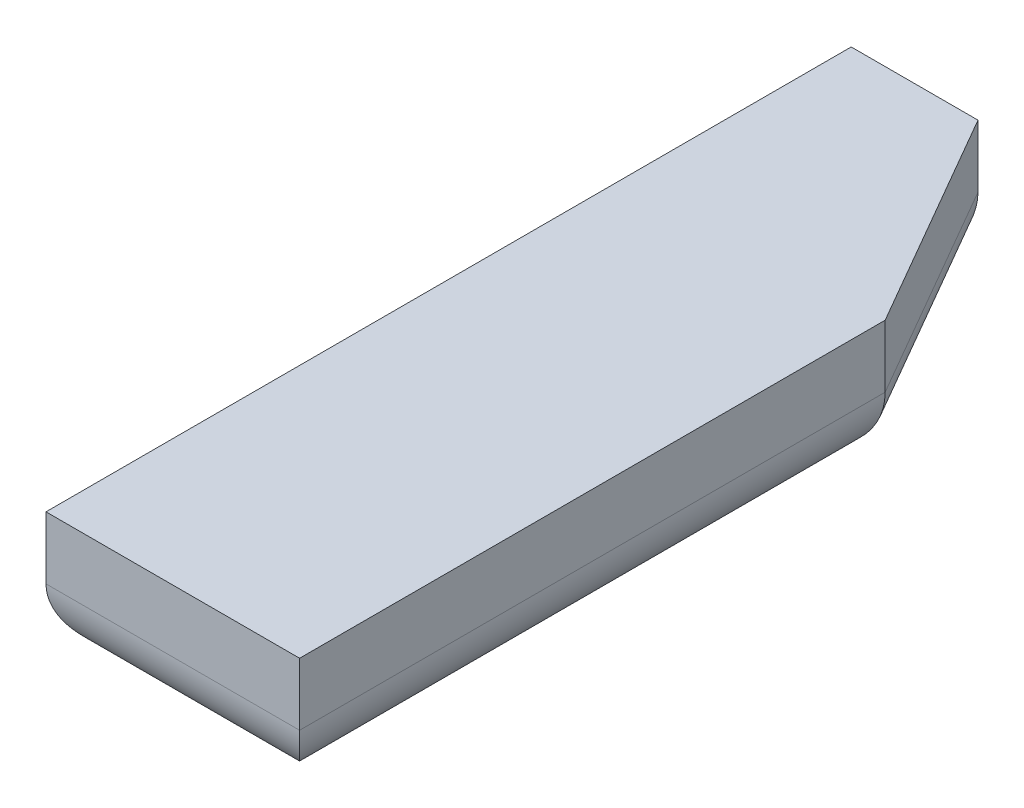
ISO-10303-21;
HEADER;
FILE_DESCRIPTION(('STEP AP214'),'2;1');
FILE_NAME('part.step','',(''),(''),'','','');
FILE_SCHEMA(('AUTOMOTIVE_DESIGN { 1 0 10303 214 1 1 1 1 }'));
ENDSEC;
DATA;
#1=APPLICATION_CONTEXT('core data for automotive mechanical design processes');
#2=APPLICATION_PROTOCOL_DEFINITION('international standard','automotive_design',2000,#1);
#3=PRODUCT_CONTEXT('',#1,'mechanical');
#4=PRODUCT('Part','Part','',(#3));
#5=PRODUCT_RELATED_PRODUCT_CATEGORY('part','',(#4));
#6=PRODUCT_DEFINITION_FORMATION('','',#4);
#7=PRODUCT_DEFINITION_CONTEXT('part definition',#1,'design');
#8=PRODUCT_DEFINITION('design','',#6,#7);
#9=PRODUCT_DEFINITION_SHAPE('','',#8);
#10=(LENGTH_UNIT() NAMED_UNIT(*) SI_UNIT(.MILLI.,.METRE.));
#11=(NAMED_UNIT(*) PLANE_ANGLE_UNIT() SI_UNIT($,.RADIAN.));
#12=(NAMED_UNIT(*) SI_UNIT($,.STERADIAN.) SOLID_ANGLE_UNIT());
#13=UNCERTAINTY_MEASURE_WITH_UNIT(LENGTH_MEASURE(1.E-05),#10,'distance_accuracy_value','');
#14=(GEOMETRIC_REPRESENTATION_CONTEXT(3) GLOBAL_UNCERTAINTY_ASSIGNED_CONTEXT((#13)) GLOBAL_UNIT_ASSIGNED_CONTEXT((#10,
#11,#12)) REPRESENTATION_CONTEXT('',''));
#15=CARTESIAN_POINT('',(0.,0.,0.));
#16=DIRECTION('',(0.,0.,1.));
#17=DIRECTION('',(1.,0.,0.));
#18=AXIS2_PLACEMENT_3D('',#15,#16,#17);
#19=CARTESIAN_POINT('',(-10.,10.,31.75));
#20=DIRECTION('',(0.,0.,-1.));
#21=DIRECTION('',(-1.,0.,0.));
#22=AXIS2_PLACEMENT_3D('',#19,#20,#21);
#23=PLANE('',#22);
#24=DIRECTION('',(0.,-1.,0.));
#25=VECTOR('',#24,1.);
#26=CARTESIAN_POINT('',(-10.,10.,31.75));
#27=LINE('',#26,#25);
#28=CARTESIAN_POINT('',(-10.,10.,31.75));
#29=VERTEX_POINT('',#28);
#30=CARTESIAN_POINT('',(-10.,5.08,31.75));
#31=VERTEX_POINT('',#30);
#32=EDGE_CURVE('E176',#29,#31,#27,.T.);
#33=ORIENTED_EDGE('',*,*,#32,.T.);
#34=DIRECTION('',(1.,0.,0.));
#35=VECTOR('',#34,1.);
#36=CARTESIAN_POINT('',(-10.,5.08,31.75));
#37=LINE('',#36,#35);
#38=CARTESIAN_POINT('',(10.,5.08,31.75));
#39=VERTEX_POINT('',#38);
#40=EDGE_CURVE('E11',#31,#39,#37,.T.);
#41=ORIENTED_EDGE('',*,*,#40,.T.);
#42=DIRECTION('',(0.,-1.,0.));
#43=VECTOR('',#42,1.);
#44=CARTESIAN_POINT('',(10.,10.,31.75));
#45=LINE('',#44,#43);
#46=CARTESIAN_POINT('',(10.,10.,31.75));
#47=VERTEX_POINT('',#46);
#48=EDGE_CURVE('E103',#47,#39,#45,.T.);
#49=ORIENTED_EDGE('',*,*,#48,.F.);
#50=DIRECTION('',(1.,0.,0.));
#51=VECTOR('',#50,1.);
#52=CARTESIAN_POINT('',(-10.,10.,31.75));
#53=LINE('',#52,#51);
#54=EDGE_CURVE('E110',#29,#47,#53,.T.);
#55=ORIENTED_EDGE('',*,*,#54,.F.);
#56=EDGE_LOOP('',(#33,#41,#49,#55));
#57=FACE_BOUND('',#56,.T.);
#58=ADVANCED_FACE('F33',(#57),#23,.F.);
#59=CARTESIAN_POINT('',(10.,10.,31.75));
#60=DIRECTION('',(-1.,0.,0.));
#61=DIRECTION('',(0.,0.,1.));
#62=AXIS2_PLACEMENT_3D('',#59,#60,#61);
#63=PLANE('',#62);
#64=ORIENTED_EDGE('',*,*,#48,.T.);
#65=DIRECTION('',(0.,0.,-1.));
#66=VECTOR('',#65,1.);
#67=CARTESIAN_POINT('',(10.,5.08,31.75));
#68=LINE('',#67,#66);
#69=CARTESIAN_POINT('',(10.,5.08,-14.4294919243111));
#70=VERTEX_POINT('',#69);
#71=EDGE_CURVE('E119',#39,#70,#68,.T.);
#72=ORIENTED_EDGE('',*,*,#71,.T.);
#73=DIRECTION('',(0.,-1.,0.));
#74=VECTOR('',#73,1.);
#75=CARTESIAN_POINT('',(10.,10.,-14.4294919243111));
#76=LINE('',#75,#74);
#77=CARTESIAN_POINT('',(10.,10.,-14.4294919243111));
#78=VERTEX_POINT('',#77);
#79=EDGE_CURVE('E106',#78,#70,#76,.T.);
#80=ORIENTED_EDGE('',*,*,#79,.F.);
#81=DIRECTION('',(0.,0.,-1.));
#82=VECTOR('',#81,1.);
#83=CARTESIAN_POINT('',(10.,10.,31.75));
#84=LINE('',#83,#82);
#85=EDGE_CURVE('E98',#47,#78,#84,.T.);
#86=ORIENTED_EDGE('',*,*,#85,.F.);
#87=EDGE_LOOP('',(#64,#72,#80,#86));
#88=FACE_BOUND('',#87,.T.);
#89=ADVANCED_FACE('F100',(#88),#63,.F.);
#90=CARTESIAN_POINT('',(10.,10.,-14.4294919243111));
#91=DIRECTION('',(-0.86602540378444,0.,0.499999999999998));
#92=DIRECTION('',(0.499999999999998,0.,0.86602540378444));
#93=AXIS2_PLACEMENT_3D('',#90,#91,#92);
#94=PLANE('',#93);
#95=ORIENTED_EDGE('',*,*,#79,.T.);
#96=DIRECTION('',(-0.499999999999998,0.,-0.86602540378444));
#97=VECTOR('',#96,1.);
#98=CARTESIAN_POINT('',(10.,5.08,-14.4294919243111));
#99=LINE('',#98,#97);
#100=CARTESIAN_POINT('',(0.,5.08,-31.75));
#101=VERTEX_POINT('',#100);
#102=EDGE_CURVE('E137',#70,#101,#99,.T.);
#103=ORIENTED_EDGE('',*,*,#102,.T.);
#104=DIRECTION('',(0.,-1.,0.));
#105=VECTOR('',#104,1.);
#106=CARTESIAN_POINT('',(0.,10.,-31.75));
#107=LINE('',#106,#105);
#108=CARTESIAN_POINT('',(0.,10.,-31.75));
#109=VERTEX_POINT('',#108);
#110=EDGE_CURVE('E123',#109,#101,#107,.T.);
#111=ORIENTED_EDGE('',*,*,#110,.F.);
#112=DIRECTION('',(-0.499999999999998,0.,-0.86602540378444));
#113=VECTOR('',#112,1.);
#114=CARTESIAN_POINT('',(10.,10.,-14.4294919243111));
#115=LINE('',#114,#113);
#116=EDGE_CURVE('E109',#78,#109,#115,.T.);
#117=ORIENTED_EDGE('',*,*,#116,.F.);
#118=EDGE_LOOP('',(#95,#103,#111,#117));
#119=FACE_BOUND('',#118,.T.);
#120=ADVANCED_FACE('F168',(#119),#94,.F.);
#121=CARTESIAN_POINT('',(0.,10.,-31.75));
#122=DIRECTION('',(0.,0.,1.));
#123=DIRECTION('',(1.,0.,0.));
#124=AXIS2_PLACEMENT_3D('',#121,#122,#123);
#125=PLANE('',#124);
#126=ORIENTED_EDGE('',*,*,#110,.T.);
#127=DIRECTION('',(-1.,0.,0.));
#128=VECTOR('',#127,1.);
#129=CARTESIAN_POINT('',(0.,5.08,-31.75));
#130=LINE('',#129,#128);
#131=CARTESIAN_POINT('',(-10.,5.08,-31.75));
#132=VERTEX_POINT('',#131);
#133=EDGE_CURVE('E57',#101,#132,#130,.T.);
#134=ORIENTED_EDGE('',*,*,#133,.T.);
#135=DIRECTION('',(0.,-1.,0.));
#136=VECTOR('',#135,1.);
#137=CARTESIAN_POINT('',(-10.,10.,-31.75));
#138=LINE('',#137,#136);
#139=CARTESIAN_POINT('',(-10.,10.,-31.75));
#140=VERTEX_POINT('',#139);
#141=EDGE_CURVE('E178',#140,#132,#138,.T.);
#142=ORIENTED_EDGE('',*,*,#141,.F.);
#143=DIRECTION('',(-1.,0.,0.));
#144=VECTOR('',#143,1.);
#145=CARTESIAN_POINT('',(0.,10.,-31.75));
#146=LINE('',#145,#144);
#147=EDGE_CURVE('E171',#109,#140,#146,.T.);
#148=ORIENTED_EDGE('',*,*,#147,.F.);
#149=EDGE_LOOP('',(#126,#134,#142,#148));
#150=FACE_BOUND('',#149,.T.);
#151=ADVANCED_FACE('F179',(#150),#125,.F.);
#152=CARTESIAN_POINT('',(-10.,10.,-31.75));
#153=DIRECTION('',(1.,0.,0.));
#154=DIRECTION('',(0.,0.,-1.));
#155=AXIS2_PLACEMENT_3D('',#152,#153,#154);
#156=PLANE('',#155);
#157=ORIENTED_EDGE('',*,*,#141,.T.);
#158=DIRECTION('',(0.,0.,1.));
#159=VECTOR('',#158,1.);
#160=CARTESIAN_POINT('',(-10.,5.08,-31.75));
#161=LINE('',#160,#159);
#162=EDGE_CURVE('E42',#132,#31,#161,.T.);
#163=ORIENTED_EDGE('',*,*,#162,.T.);
#164=ORIENTED_EDGE('',*,*,#32,.F.);
#165=DIRECTION('',(0.,0.,1.));
#166=VECTOR('',#165,1.);
#167=CARTESIAN_POINT('',(-10.,10.,-31.75));
#168=LINE('',#167,#166);
#169=EDGE_CURVE('E115',#140,#29,#168,.T.);
#170=ORIENTED_EDGE('',*,*,#169,.F.);
#171=EDGE_LOOP('',(#157,#163,#164,#170));
#172=FACE_BOUND('',#171,.T.);
#173=ADVANCED_FACE('F180',(#172),#156,.F.);
#174=CARTESIAN_POINT('',(0.,10.,0.));
#175=DIRECTION('',(0.,1.,0.));
#176=DIRECTION('',(0.,0.,1.));
#177=AXIS2_PLACEMENT_3D('',#174,#175,#176);
#178=PLANE('',#177);
#179=ORIENTED_EDGE('',*,*,#54,.T.);
#180=ORIENTED_EDGE('',*,*,#85,.T.);
#181=ORIENTED_EDGE('',*,*,#116,.T.);
#182=ORIENTED_EDGE('',*,*,#147,.T.);
#183=ORIENTED_EDGE('',*,*,#169,.T.);
#184=EDGE_LOOP('',(#179,#180,#181,#182,#183));
#185=FACE_BOUND('',#184,.T.);
#186=ADVANCED_FACE('F113',(#185),#178,.T.);
#187=CARTESIAN_POINT('',(0.,0.,0.));
#188=DIRECTION('',(0.,1.,0.));
#189=DIRECTION('',(0.,0.,1.));
#190=AXIS2_PLACEMENT_3D('',#187,#188,#189);
#191=PLANE('',#190);
#192=DIRECTION('',(-0.499999999999998,0.,-0.86602540378444));
#193=VECTOR('',#192,1.);
#194=CARTESIAN_POINT('',(9.34874423385297,0.,-5.39749999999995));
#195=LINE('',#194,#193);
#196=CARTESIAN_POINT('',(-2.93293936748331,0.,-26.67));
#197=VERTEX_POINT('',#196);
#198=CARTESIAN_POINT('',(4.92,0.,-13.068310026761));
#199=VERTEX_POINT('',#198);
#200=EDGE_CURVE('E132',#197,#199,#195,.F.);
#201=ORIENTED_EDGE('',*,*,#200,.T.);
#202=DIRECTION('',(0.,0.,-1.));
#203=VECTOR('',#202,1.);
#204=CARTESIAN_POINT('',(4.92,0.,0.));
#205=LINE('',#204,#203);
#206=CARTESIAN_POINT('',(4.92,0.,26.67));
#207=VERTEX_POINT('',#206);
#208=EDGE_CURVE('E134',#199,#207,#205,.F.);
#209=ORIENTED_EDGE('',*,*,#208,.T.);
#210=DIRECTION('',(1.,0.,0.));
#211=VECTOR('',#210,1.);
#212=CARTESIAN_POINT('',(0.,0.,26.67));
#213=LINE('',#212,#211);
#214=CARTESIAN_POINT('',(-4.92,0.,26.67));
#215=VERTEX_POINT('',#214);
#216=EDGE_CURVE('E121',#207,#215,#213,.F.);
#217=ORIENTED_EDGE('',*,*,#216,.T.);
#218=DIRECTION('',(0.,0.,1.));
#219=VECTOR('',#218,1.);
#220=CARTESIAN_POINT('',(-4.92,0.,0.));
#221=LINE('',#220,#219);
#222=CARTESIAN_POINT('',(-4.92,0.,-26.67));
#223=VERTEX_POINT('',#222);
#224=EDGE_CURVE('E128',#215,#223,#221,.F.);
#225=ORIENTED_EDGE('',*,*,#224,.T.);
#226=DIRECTION('',(-1.,0.,0.));
#227=VECTOR('',#226,1.);
#228=CARTESIAN_POINT('',(0.,0.,-26.67));
#229=LINE('',#228,#227);
#230=EDGE_CURVE('E130',#223,#197,#229,.F.);
#231=ORIENTED_EDGE('',*,*,#230,.T.);
#232=EDGE_LOOP('',(#201,#209,#217,#225,#231));
#233=FACE_BOUND('',#232,.T.);
#234=ADVANCED_FACE('F187',(#233),#191,.F.);
#235=CARTESIAN_POINT('',(-4.92,5.08,-31.75));
#236=DIRECTION('',(0.,0.,1.));
#237=DIRECTION('',(1.,0.,0.));
#238=AXIS2_PLACEMENT_3D('',#235,#236,#237);
#239=CYLINDRICAL_SURFACE('',#238,5.08);
#240=CARTESIAN_POINT('',(-4.92,5.08,26.67));
#241=DIRECTION('',(0.707106781186547,0.,0.707106781186547));
#242=DIRECTION('',(0.707106781186547,0.,-0.707106781186547));
#243=AXIS2_PLACEMENT_3D('',#240,#241,#242);
#244=ELLIPSE('',#243,7.18420489685532,5.08);
#245=EDGE_CURVE('E147',#31,#215,#244,.T.);
#246=ORIENTED_EDGE('',*,*,#245,.F.);
#247=ORIENTED_EDGE('',*,*,#162,.F.);
#248=CARTESIAN_POINT('',(-4.92,5.08,-26.67));
#249=DIRECTION('',(-0.707106781186547,0.,0.707106781186547));
#250=DIRECTION('',(0.707106781186547,0.,0.707106781186547));
#251=AXIS2_PLACEMENT_3D('',#248,#249,#250);
#252=ELLIPSE('',#251,7.18420489685532,5.08);
#253=EDGE_CURVE('E37',#223,#132,#252,.F.);
#254=ORIENTED_EDGE('',*,*,#253,.F.);
#255=ORIENTED_EDGE('',*,*,#224,.F.);
#256=EDGE_LOOP('',(#246,#247,#254,#255));
#257=FACE_BOUND('',#256,.T.);
#258=ADVANCED_FACE('F35',(#257),#239,.T.);
#259=CARTESIAN_POINT('',(0.,5.08,-26.67));
#260=DIRECTION('',(-1.,0.,0.));
#261=DIRECTION('',(0.,0.,1.));
#262=AXIS2_PLACEMENT_3D('',#259,#260,#261);
#263=CYLINDRICAL_SURFACE('',#262,5.08);
#264=ORIENTED_EDGE('',*,*,#253,.T.);
#265=ORIENTED_EDGE('',*,*,#133,.F.);
#266=CARTESIAN_POINT('',(-2.9329393674833,5.08,-26.67));
#267=DIRECTION('',(-0.866025403784438,0.,-0.500000000000001));
#268=DIRECTION('',(-0.500000000000001,0.,0.866025403784438));
#269=AXIS2_PLACEMENT_3D('',#266,#267,#268);
#270=ELLIPSE('',#269,5.8658787349666,5.08);
#271=EDGE_CURVE('E145',#197,#101,#270,.F.);
#272=ORIENTED_EDGE('',*,*,#271,.F.);
#273=ORIENTED_EDGE('',*,*,#230,.F.);
#274=EDGE_LOOP('',(#264,#265,#272,#273));
#275=FACE_BOUND('',#274,.T.);
#276=ADVANCED_FACE('F156',(#275),#263,.T.);
#277=CARTESIAN_POINT('',(-10.,5.08,26.67));
#278=DIRECTION('',(1.,0.,0.));
#279=DIRECTION('',(0.,0.,-1.));
#280=AXIS2_PLACEMENT_3D('',#277,#278,#279);
#281=CYLINDRICAL_SURFACE('',#280,5.08);
#282=ORIENTED_EDGE('',*,*,#245,.T.);
#283=ORIENTED_EDGE('',*,*,#216,.F.);
#284=CARTESIAN_POINT('',(4.92,5.08,26.67));
#285=DIRECTION('',(0.707106781186547,0.,-0.707106781186547));
#286=DIRECTION('',(0.707106781186547,0.,0.707106781186547));
#287=AXIS2_PLACEMENT_3D('',#284,#285,#286);
#288=ELLIPSE('',#287,7.18420489685532,5.08);
#289=EDGE_CURVE('E143',#39,#207,#288,.T.);
#290=ORIENTED_EDGE('',*,*,#289,.F.);
#291=ORIENTED_EDGE('',*,*,#40,.F.);
#292=EDGE_LOOP('',(#282,#283,#290,#291));
#293=FACE_BOUND('',#292,.T.);
#294=ADVANCED_FACE('F160',(#293),#281,.T.);
#295=CARTESIAN_POINT('',(5.60059094877505,5.08,-11.8894919243111));
#296=DIRECTION('',(-0.499999999999998,0.,-0.86602540378444));
#297=DIRECTION('',(-0.86602540378444,0.,0.499999999999998));
#298=AXIS2_PLACEMENT_3D('',#295,#296,#297);
#299=CYLINDRICAL_SURFACE('',#298,5.08);
#300=ORIENTED_EDGE('',*,*,#271,.T.);
#301=ORIENTED_EDGE('',*,*,#102,.F.);
#302=CARTESIAN_POINT('',(4.92,5.08,-13.068310026761));
#303=DIRECTION('',(-0.25881904510252,0.,-0.965925826289069));
#304=DIRECTION('',(-0.965925826289069,0.,0.25881904510252));
#305=AXIS2_PLACEMENT_3D('',#302,#303,#304);
#306=ELLIPSE('',#305,5.25920299648322,5.08);
#307=EDGE_CURVE('E141',#199,#70,#306,.F.);
#308=ORIENTED_EDGE('',*,*,#307,.F.);
#309=ORIENTED_EDGE('',*,*,#200,.F.);
#310=EDGE_LOOP('',(#300,#301,#308,#309));
#311=FACE_BOUND('',#310,.T.);
#312=ADVANCED_FACE('F201',(#311),#299,.T.);
#313=CARTESIAN_POINT('',(4.92,5.08,31.75));
#314=DIRECTION('',(0.,0.,-1.));
#315=DIRECTION('',(-1.,0.,0.));
#316=AXIS2_PLACEMENT_3D('',#313,#314,#315);
#317=CYLINDRICAL_SURFACE('',#316,5.08);
#318=ORIENTED_EDGE('',*,*,#289,.T.);
#319=ORIENTED_EDGE('',*,*,#208,.F.);
#320=ORIENTED_EDGE('',*,*,#307,.T.);
#321=ORIENTED_EDGE('',*,*,#71,.F.);
#322=EDGE_LOOP('',(#318,#319,#320,#321));
#323=FACE_BOUND('',#322,.T.);
#324=ADVANCED_FACE('F164',(#323),#317,.T.);
#325=CLOSED_SHELL('',(#58,#89,#120,#151,#173,#186,#234,#258,#276,#294,#312,#324));
#326=MANIFOLD_SOLID_BREP('B2',#325);
#327=ADVANCED_BREP_SHAPE_REPRESENTATION('',(#18,#326),#14);
#328=SHAPE_DEFINITION_REPRESENTATION(#9,#327);
ENDSEC;
END-ISO-10303-21;
